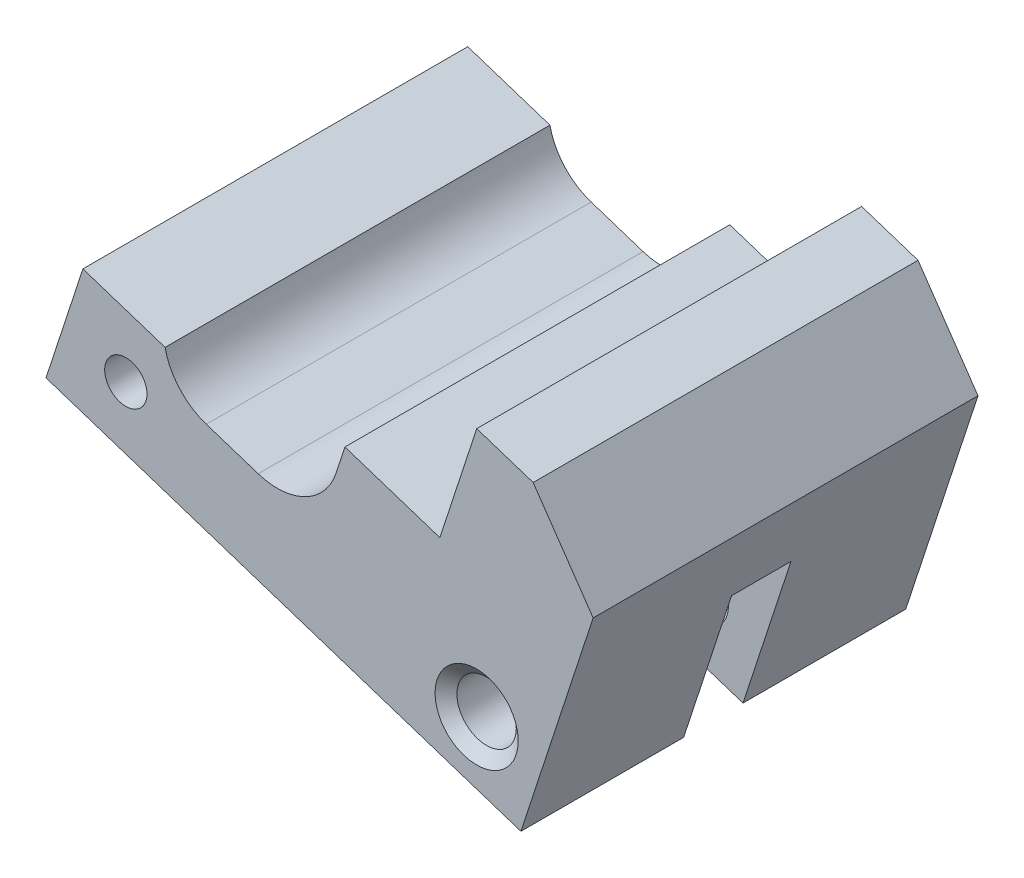
ISO-10303-21;
HEADER;
FILE_DESCRIPTION(('STEP AP214'),'2;1');
FILE_NAME('part.step','',(''),(''),'','','');
FILE_SCHEMA(('AUTOMOTIVE_DESIGN { 1 0 10303 214 1 1 1 1 }'));
ENDSEC;
DATA;
#1=APPLICATION_CONTEXT('core data for automotive mechanical design processes');
#2=APPLICATION_PROTOCOL_DEFINITION('international standard','automotive_design',2000,#1);
#3=PRODUCT_CONTEXT('',#1,'mechanical');
#4=PRODUCT('Part','Part','',(#3));
#5=PRODUCT_RELATED_PRODUCT_CATEGORY('part','',(#4));
#6=PRODUCT_DEFINITION_FORMATION('','',#4);
#7=PRODUCT_DEFINITION_CONTEXT('part definition',#1,'design');
#8=PRODUCT_DEFINITION('design','',#6,#7);
#9=PRODUCT_DEFINITION_SHAPE('','',#8);
#10=(LENGTH_UNIT() NAMED_UNIT(*) SI_UNIT(.MILLI.,.METRE.));
#11=(NAMED_UNIT(*) PLANE_ANGLE_UNIT() SI_UNIT($,.RADIAN.));
#12=(NAMED_UNIT(*) SI_UNIT($,.STERADIAN.) SOLID_ANGLE_UNIT());
#13=UNCERTAINTY_MEASURE_WITH_UNIT(LENGTH_MEASURE(1.E-05),#10,'distance_accuracy_value','');
#14=(GEOMETRIC_REPRESENTATION_CONTEXT(3) GLOBAL_UNCERTAINTY_ASSIGNED_CONTEXT((#13)) GLOBAL_UNIT_ASSIGNED_CONTEXT((#10,
#11,#12)) REPRESENTATION_CONTEXT('',''));
#15=CARTESIAN_POINT('',(0.,0.,0.));
#16=DIRECTION('',(0.,0.,1.));
#17=DIRECTION('',(1.,0.,0.));
#18=AXIS2_PLACEMENT_3D('',#15,#16,#17);
#19=CARTESIAN_POINT('',(8.99758083651037,-79.2807795563103,21.8561432963201));
#20=DIRECTION('',(0.,0.,1.));
#21=DIRECTION('',(1.,0.,0.));
#22=AXIS2_PLACEMENT_3D('',#19,#20,#21);
#23=CYLINDRICAL_SURFACE('',#22,1.5875);
#24=CARTESIAN_POINT('',(8.99758083651037,-79.2807795563103,9.97557164816008));
#25=DIRECTION('',(0.,0.,-1.));
#26=DIRECTION('',(-1.,0.,0.));
#27=AXIS2_PLACEMENT_3D('',#24,#25,#26);
#28=CIRCLE('',#27,1.5875);
#29=CARTESIAN_POINT('',(7.41008083651038,-79.2807795563103,9.97557164816008));
#30=VERTEX_POINT('',#29);
#31=EDGE_CURVE('E206',#30,#30,#28,.F.);
#32=ORIENTED_EDGE('',*,*,#31,.T.);
#33=EDGE_LOOP('',(#32));
#34=FACE_BOUND('',#33,.T.);
#35=CARTESIAN_POINT('',(8.99758083651037,-79.2807795563103,1.27));
#36=DIRECTION('',(0.,0.,1.));
#37=DIRECTION('',(1.,0.,0.));
#38=AXIS2_PLACEMENT_3D('',#35,#36,#37);
#39=CIRCLE('',#38,1.5875);
#40=CARTESIAN_POINT('',(10.5850808365104,-79.2807795563103,1.27));
#41=VERTEX_POINT('',#40);
#42=EDGE_CURVE('E218',#41,#41,#39,.T.);
#43=ORIENTED_EDGE('',*,*,#42,.F.);
#44=EDGE_LOOP('',(#43));
#45=FACE_BOUND('',#44,.T.);
#46=ADVANCED_FACE('F37',(#34,#45),#23,.F.);
#47=CARTESIAN_POINT('',(-34.8598381796,-193.67470749233,21.85614329632));
#48=DIRECTION('',(0.,0.,-1.));
#49=DIRECTION('',(-0.999995874513973,-0.00287244756860379,0.));
#50=AXIS2_PLACEMENT_3D('',#47,#48,#49);
#51=PLANE('',#50);
#52=CARTESIAN_POINT('',(8.99758083651037,-79.2807795563103,21.8561432963201));
#53=DIRECTION('',(0.,0.,1.));
#54=DIRECTION('',(1.,0.,0.));
#55=AXIS2_PLACEMENT_3D('',#52,#53,#54);
#56=CIRCLE('',#55,2.2225);
#57=CARTESIAN_POINT('',(11.2200808365104,-79.2807795563103,21.8561432963201));
#58=VERTEX_POINT('',#57);
#59=EDGE_CURVE('E209',#58,#58,#56,.T.);
#60=ORIENTED_EDGE('',*,*,#59,.F.);
#61=EDGE_LOOP('',(#60));
#62=FACE_BOUND('',#61,.T.);
#63=DIRECTION('',(0.950482556507389,-0.310777910693759,0.));
#64=VECTOR('',#63,1.);
#65=CARTESIAN_POINT('',(7.02998574408476,-71.9566208494996,21.8561432963201));
#66=LINE('',#65,#64);
#67=CARTESIAN_POINT('',(1.9525643231755,-70.296463690277,21.8561432963201));
#68=VERTEX_POINT('',#67);
#69=CARTESIAN_POINT('',(7.02998574408469,-71.9566208494996,21.8561432963201));
#70=VERTEX_POINT('',#69);
#71=EDGE_CURVE('E203',#68,#70,#66,.T.);
#72=ORIENTED_EDGE('',*,*,#71,.F.);
#73=DIRECTION('',(0.310777910693755,0.950482556507391,0.));
#74=VECTOR('',#73,1.);
#75=CARTESIAN_POINT('',(22.5287809016616,-7.36620299989832,21.8561432963201));
#76=LINE('',#75,#74);
#77=CARTESIAN_POINT('',(1.47893878727822,-71.7449991063943,21.8561432963201));
#78=VERTEX_POINT('',#77);
#79=EDGE_CURVE('E52',#78,#68,#76,.T.);
#80=ORIENTED_EDGE('',*,*,#79,.F.);
#81=CARTESIAN_POINT('',(-1.65955461430918,-70.7188104452835,21.8561432963201));
#82=DIRECTION('',(0.,0.,1.));
#83=DIRECTION('',(1.,0.,0.));
#84=AXIS2_PLACEMENT_3D('',#81,#82,#83);
#85=CIRCLE('',#84,3.302);
#86=CARTESIAN_POINT('',(-2.68574327541997,-73.8573038468709,21.8561432963201));
#87=VERTEX_POINT('',#86);
#88=EDGE_CURVE('E303',#87,#78,#85,.T.);
#89=ORIENTED_EDGE('',*,*,#88,.F.);
#90=DIRECTION('',(-0.95048255650739,0.310777910693756,0.));
#91=VECTOR('',#90,1.);
#92=CARTESIAN_POINT('',(-22.0760307754942,-67.5172895080833,21.8561432963201));
#93=LINE('',#92,#91);
#94=CARTESIAN_POINT('',(-5.46210282297806,-72.9495215697344,21.8561432963201));
#95=VERTEX_POINT('',#94);
#96=EDGE_CURVE('E301',#87,#95,#93,.T.);
#97=ORIENTED_EDGE('',*,*,#96,.T.);
#98=CARTESIAN_POINT('',(-4.43591416186727,-69.811028168147,21.8561432963201));
#99=DIRECTION('',(0.,0.,1.));
#100=DIRECTION('',(1.,0.,0.));
#101=AXIS2_PLACEMENT_3D('',#98,#99,#100);
#102=CIRCLE('',#101,3.30199999999999);
#103=CARTESIAN_POINT('',(-7.66702350780718,-70.4915694193432,21.8561432963201));
#104=VERTEX_POINT('',#103);
#105=EDGE_CURVE('E298',#104,#95,#102,.T.);
#106=ORIENTED_EDGE('',*,*,#105,.F.);
#107=DIRECTION('',(0.950482556507389,-0.310777910693759,0.));
#108=VECTOR('',#107,1.);
#109=CARTESIAN_POINT('',(0.00770164381015448,-73.0009632335052,21.8561432963201));
#110=LINE('',#109,#108);
#111=CARTESIAN_POINT('',(-12.0634268238338,-69.0540837676944,21.8561432963201));
#112=VERTEX_POINT('',#111);
#113=EDGE_CURVE('E170',#112,#104,#110,.T.);
#114=ORIENTED_EDGE('',*,*,#113,.F.);
#115=DIRECTION('',(0.310777910693759,0.950482556507389,0.));
#116=VECTOR('',#115,1.);
#117=CARTESIAN_POINT('',(-12.0634268238337,-69.0540837676944,21.8561432963201));
#118=LINE('',#117,#116);
#119=CARTESIAN_POINT('',(-14.0368665567391,-75.0896480015163,21.8561432963201));
#120=VERTEX_POINT('',#119);
#121=EDGE_CURVE('E45',#120,#112,#118,.T.);
#122=ORIENTED_EDGE('',*,*,#121,.F.);
#123=DIRECTION('',(-0.950482556507389,0.310777910693758,0.));
#124=VECTOR('',#123,1.);
#125=CARTESIAN_POINT('',(-14.0368665567391,-75.0896480015164,21.8561432963201));
#126=LINE('',#125,#124);
#127=CARTESIAN_POINT('',(11.3653114031524,-83.3953614934659,21.8561432963202));
#128=VERTEX_POINT('',#127);
#129=EDGE_CURVE('E244',#128,#120,#126,.T.);
#130=ORIENTED_EDGE('',*,*,#129,.F.);
#131=DIRECTION('',(-0.310777910693758,-0.950482556507389,0.));
#132=VECTOR('',#131,1.);
#133=CARTESIAN_POINT('',(11.3653114031524,-83.3953614934658,21.8561432963202));
#134=LINE('',#133,#132);
#135=CARTESIAN_POINT('',(15.2291208064125,-71.5782943432628,21.8561432963202));
#136=VERTEX_POINT('',#135);
#137=EDGE_CURVE('E241',#136,#128,#134,.T.);
#138=ORIENTED_EDGE('',*,*,#137,.F.);
#139=DIRECTION('',(0.566161107256144,-0.824294607910605,0.));
#140=VECTOR('',#139,1.);
#141=CARTESIAN_POINT('',(12.021207593901,-66.9077764821303,21.8561432963202));
#142=LINE('',#141,#140);
#143=CARTESIAN_POINT('',(12.021207593901,-66.9077764821303,21.8561432963202));
#144=VERTEX_POINT('',#143);
#145=EDGE_CURVE('E238',#144,#136,#142,.T.);
#146=ORIENTED_EDGE('',*,*,#145,.F.);
#147=DIRECTION('',(0.950482556507389,-0.310777910693759,0.));
#148=VECTOR('',#147,1.);
#149=CARTESIAN_POINT('',(12.0212075939011,-66.9077764821303,21.8561432963202));
#150=LINE('',#149,#148);
#151=CARTESIAN_POINT('',(9.00342547699006,-65.9210566156776,21.8561432963201));
#152=VERTEX_POINT('',#151);
#153=EDGE_CURVE('E235',#152,#144,#150,.T.);
#154=ORIENTED_EDGE('',*,*,#153,.F.);
#155=DIRECTION('',(0.310777910693759,0.950482556507389,0.));
#156=VECTOR('',#155,1.);
#157=CARTESIAN_POINT('',(8.01670561053738,-68.9388387325886,21.8561432963201));
#158=LINE('',#157,#156);
#159=EDGE_CURVE('E232',#70,#152,#158,.T.);
#160=ORIENTED_EDGE('',*,*,#159,.F.);
#161=EDGE_LOOP('',(#72,#80,#89,#97,#106,#114,#122,#130,#138,#146,#154,#160));
#162=FACE_BOUND('',#161,.T.);
#163=CARTESIAN_POINT('',(-9.76679974708732,-73.1454170993059,21.8561432963201));
#164=DIRECTION('',(0.,0.,1.));
#165=DIRECTION('',(1.,0.,0.));
#166=AXIS2_PLACEMENT_3D('',#163,#164,#165);
#167=CIRCLE('',#166,1.13029999999999);
#168=CARTESIAN_POINT('',(-8.63649974708733,-73.1454170993059,21.8561432963201));
#169=VERTEX_POINT('',#168);
#170=EDGE_CURVE('E225',#169,#169,#167,.T.);
#171=ORIENTED_EDGE('',*,*,#170,.F.);
#172=EDGE_LOOP('',(#171));
#173=FACE_BOUND('',#172,.T.);
#174=ADVANCED_FACE('F277',(#62,#162,#173),#51,.F.);
#175=CARTESIAN_POINT('',(0.,0.,1.27));
#176=DIRECTION('',(0.,0.,1.));
#177=DIRECTION('',(1.,0.,0.));
#178=AXIS2_PLACEMENT_3D('',#175,#176,#177);
#179=PLANE('',#178);
#180=ORIENTED_EDGE('',*,*,#42,.T.);
#181=EDGE_LOOP('',(#180));
#182=FACE_BOUND('',#181,.T.);
#183=CARTESIAN_POINT('',(-9.76679974708732,-73.1454170993059,1.27));
#184=DIRECTION('',(0.,0.,1.));
#185=DIRECTION('',(1.,0.,0.));
#186=AXIS2_PLACEMENT_3D('',#183,#184,#185);
#187=CIRCLE('',#186,1.13029999999999);
#188=CARTESIAN_POINT('',(-8.63649974708732,-73.1454170993059,1.27));
#189=VERTEX_POINT('',#188);
#190=EDGE_CURVE('E228',#189,#189,#187,.T.);
#191=ORIENTED_EDGE('',*,*,#190,.T.);
#192=EDGE_LOOP('',(#191));
#193=FACE_BOUND('',#192,.T.);
#194=CARTESIAN_POINT('',(-1.65955461430918,-70.7188104452835,1.27));
#195=DIRECTION('',(0.,0.,1.));
#196=DIRECTION('',(1.,0.,0.));
#197=AXIS2_PLACEMENT_3D('',#194,#195,#196);
#198=CIRCLE('',#197,3.302);
#199=CARTESIAN_POINT('',(-2.68574327541997,-73.8573038468709,1.27));
#200=VERTEX_POINT('',#199);
#201=CARTESIAN_POINT('',(1.47893878727822,-71.7449991063943,1.27));
#202=VERTEX_POINT('',#201);
#203=EDGE_CURVE('E562',#200,#202,#198,.T.);
#204=ORIENTED_EDGE('',*,*,#203,.T.);
#205=DIRECTION('',(0.310777910693755,0.950482556507391,0.));
#206=VECTOR('',#205,1.);
#207=CARTESIAN_POINT('',(22.5287809016616,-7.36620299989832,1.27));
#208=LINE('',#207,#206);
#209=CARTESIAN_POINT('',(1.9525643231755,-70.296463690277,1.27));
#210=VERTEX_POINT('',#209);
#211=EDGE_CURVE('E171',#202,#210,#208,.T.);
#212=ORIENTED_EDGE('',*,*,#211,.T.);
#213=DIRECTION('',(-0.950482556507389,0.310777910693759,0.));
#214=VECTOR('',#213,1.);
#215=CARTESIAN_POINT('',(7.02998574408469,-71.9566208494996,1.27));
#216=LINE('',#215,#214);
#217=CARTESIAN_POINT('',(7.02998574408469,-71.9566208494996,1.27));
#218=VERTEX_POINT('',#217);
#219=EDGE_CURVE('E180',#218,#210,#216,.T.);
#220=ORIENTED_EDGE('',*,*,#219,.F.);
#221=DIRECTION('',(-0.310777910693759,-0.950482556507389,0.));
#222=VECTOR('',#221,1.);
#223=CARTESIAN_POINT('',(8.01670561053737,-68.9388387325886,1.27));
#224=LINE('',#223,#222);
#225=CARTESIAN_POINT('',(9.00342547699006,-65.9210566156776,1.27));
#226=VERTEX_POINT('',#225);
#227=EDGE_CURVE('E185',#226,#218,#224,.T.);
#228=ORIENTED_EDGE('',*,*,#227,.F.);
#229=DIRECTION('',(-0.950482556507389,0.310777910693759,0.));
#230=VECTOR('',#229,1.);
#231=CARTESIAN_POINT('',(12.021207593901,-66.9077764821303,1.27));
#232=LINE('',#231,#230);
#233=CARTESIAN_POINT('',(12.021207593901,-66.9077764821303,1.27));
#234=VERTEX_POINT('',#233);
#235=EDGE_CURVE('E259',#234,#226,#232,.T.);
#236=ORIENTED_EDGE('',*,*,#235,.F.);
#237=DIRECTION('',(-0.566161107256144,0.824294607910605,0.));
#238=VECTOR('',#237,1.);
#239=CARTESIAN_POINT('',(12.021207593901,-66.9077764821303,1.27));
#240=LINE('',#239,#238);
#241=CARTESIAN_POINT('',(15.2291208064125,-71.5782943432628,1.27));
#242=VERTEX_POINT('',#241);
#243=EDGE_CURVE('E256',#242,#234,#240,.T.);
#244=ORIENTED_EDGE('',*,*,#243,.F.);
#245=DIRECTION('',(0.310777910693758,0.950482556507389,0.));
#246=VECTOR('',#245,1.);
#247=CARTESIAN_POINT('',(11.3653114031524,-83.3953614934659,1.27));
#248=LINE('',#247,#246);
#249=CARTESIAN_POINT('',(11.3653114031524,-83.3953614934659,1.27));
#250=VERTEX_POINT('',#249);
#251=EDGE_CURVE('E253',#250,#242,#248,.T.);
#252=ORIENTED_EDGE('',*,*,#251,.F.);
#253=DIRECTION('',(0.950482556507389,-0.310777910693758,0.));
#254=VECTOR('',#253,1.);
#255=CARTESIAN_POINT('',(-14.0368665567391,-75.0896480015163,1.27));
#256=LINE('',#255,#254);
#257=CARTESIAN_POINT('',(-14.0368665567391,-75.0896480015163,1.27));
#258=VERTEX_POINT('',#257);
#259=EDGE_CURVE('E250',#258,#250,#256,.T.);
#260=ORIENTED_EDGE('',*,*,#259,.F.);
#261=DIRECTION('',(-0.310777910693759,-0.950482556507389,0.));
#262=VECTOR('',#261,1.);
#263=CARTESIAN_POINT('',(-12.0634268238338,-69.0540837676944,1.27));
#264=LINE('',#263,#262);
#265=CARTESIAN_POINT('',(-12.0634268238338,-69.0540837676944,1.27));
#266=VERTEX_POINT('',#265);
#267=EDGE_CURVE('E178',#266,#258,#264,.T.);
#268=ORIENTED_EDGE('',*,*,#267,.F.);
#269=DIRECTION('',(-0.950482556507389,0.310777910693759,0.));
#270=VECTOR('',#269,1.);
#271=CARTESIAN_POINT('',(0.00770164381008439,-73.0009632335051,1.27));
#272=LINE('',#271,#270);
#273=CARTESIAN_POINT('',(-7.66702350780718,-70.4915694193432,1.27));
#274=VERTEX_POINT('',#273);
#275=EDGE_CURVE('E168',#274,#266,#272,.T.);
#276=ORIENTED_EDGE('',*,*,#275,.F.);
#277=CARTESIAN_POINT('',(-4.43591416186727,-69.811028168147,1.27));
#278=DIRECTION('',(0.,0.,1.));
#279=DIRECTION('',(1.,0.,0.));
#280=AXIS2_PLACEMENT_3D('',#277,#278,#279);
#281=CIRCLE('',#280,3.30199999999999);
#282=CARTESIAN_POINT('',(-5.46210282297806,-72.9495215697344,1.27));
#283=VERTEX_POINT('',#282);
#284=EDGE_CURVE('E152',#274,#283,#281,.T.);
#285=ORIENTED_EDGE('',*,*,#284,.T.);
#286=DIRECTION('',(-0.95048255650739,0.310777910693756,0.));
#287=VECTOR('',#286,1.);
#288=CARTESIAN_POINT('',(-22.0760307754942,-67.5172895080833,1.27));
#289=LINE('',#288,#287);
#290=EDGE_CURVE('E162',#200,#283,#289,.T.);
#291=ORIENTED_EDGE('',*,*,#290,.F.);
#292=EDGE_LOOP('',(#204,#212,#220,#228,#236,#244,#252,#260,#268,#276,#285,#291));
#293=FACE_BOUND('',#292,.T.);
#294=ADVANCED_FACE('F175',(#182,#193,#293),#179,.F.);
#295=CARTESIAN_POINT('',(0.00770164381008439,-73.0009632335051,57.2120545691913));
#296=DIRECTION('',(-0.310777910693759,-0.950482556507389,0.));
#297=DIRECTION('',(0.950482556507389,-0.310777910693759,0.));
#298=AXIS2_PLACEMENT_3D('',#295,#296,#297);
#299=PLANE('',#298);
#300=ORIENTED_EDGE('',*,*,#113,.T.);
#301=DIRECTION('',(0.,0.,1.));
#302=VECTOR('',#301,1.);
#303=CARTESIAN_POINT('',(-7.66702350780718,-70.4915694193432,1.27));
#304=LINE('',#303,#302);
#305=EDGE_CURVE('E156',#274,#104,#304,.T.);
#306=ORIENTED_EDGE('',*,*,#305,.F.);
#307=ORIENTED_EDGE('',*,*,#275,.T.);
#308=DIRECTION('',(0.,0.,-1.));
#309=VECTOR('',#308,1.);
#310=CARTESIAN_POINT('',(-12.0634268238338,-69.0540837676944,57.2120545691913));
#311=LINE('',#310,#309);
#312=EDGE_CURVE('E179',#112,#266,#311,.T.);
#313=ORIENTED_EDGE('',*,*,#312,.F.);
#314=EDGE_LOOP('',(#300,#306,#307,#313));
#315=FACE_BOUND('',#314,.T.);
#316=ADVANCED_FACE('F166',(#315),#299,.F.);
#317=CARTESIAN_POINT('',(7.02998574408469,-71.9566208494996,57.2120545691913));
#318=DIRECTION('',(-0.310777910693759,-0.950482556507389,0.));
#319=DIRECTION('',(0.950482556507389,-0.310777910693759,0.));
#320=AXIS2_PLACEMENT_3D('',#317,#318,#319);
#321=PLANE('',#320);
#322=ORIENTED_EDGE('',*,*,#219,.T.);
#323=DIRECTION('',(0.,0.,1.));
#324=VECTOR('',#323,1.);
#325=CARTESIAN_POINT('',(1.9525643231755,-70.296463690277,1.27));
#326=LINE('',#325,#324);
#327=EDGE_CURVE('E273',#210,#68,#326,.T.);
#328=ORIENTED_EDGE('',*,*,#327,.T.);
#329=ORIENTED_EDGE('',*,*,#71,.T.);
#330=DIRECTION('',(0.,0.,-1.));
#331=VECTOR('',#330,1.);
#332=CARTESIAN_POINT('',(7.02998574408469,-71.9566208494996,57.2120545691913));
#333=LINE('',#332,#331);
#334=EDGE_CURVE('E182',#70,#218,#333,.T.);
#335=ORIENTED_EDGE('',*,*,#334,.T.);
#336=EDGE_LOOP('',(#322,#328,#329,#335));
#337=FACE_BOUND('',#336,.T.);
#338=ADVANCED_FACE('F272',(#337),#321,.F.);
#339=CARTESIAN_POINT('',(8.01670561053737,-68.9388387325886,57.2120545691913));
#340=DIRECTION('',(0.950482556507389,-0.310777910693759,0.));
#341=DIRECTION('',(0.310777910693759,0.950482556507389,0.));
#342=AXIS2_PLACEMENT_3D('',#339,#340,#341);
#343=PLANE('',#342);
#344=ORIENTED_EDGE('',*,*,#334,.F.);
#345=ORIENTED_EDGE('',*,*,#159,.T.);
#346=DIRECTION('',(0.,0.,-1.));
#347=VECTOR('',#346,1.);
#348=CARTESIAN_POINT('',(9.00342547699006,-65.9210566156776,57.2120545691913));
#349=LINE('',#348,#347);
#350=EDGE_CURVE('E190',#152,#226,#349,.T.);
#351=ORIENTED_EDGE('',*,*,#350,.T.);
#352=ORIENTED_EDGE('',*,*,#227,.T.);
#353=EDGE_LOOP('',(#344,#345,#351,#352));
#354=FACE_BOUND('',#353,.T.);
#355=ADVANCED_FACE('F266',(#354),#343,.F.);
#356=CARTESIAN_POINT('',(12.021207593901,-66.9077764821303,57.2120545691913));
#357=DIRECTION('',(-0.310777910693759,-0.950482556507389,0.));
#358=DIRECTION('',(0.950482556507389,-0.310777910693759,0.));
#359=AXIS2_PLACEMENT_3D('',#356,#357,#358);
#360=PLANE('',#359);
#361=ORIENTED_EDGE('',*,*,#350,.F.);
#362=ORIENTED_EDGE('',*,*,#153,.T.);
#363=DIRECTION('',(0.,0.,-1.));
#364=VECTOR('',#363,1.);
#365=CARTESIAN_POINT('',(12.021207593901,-66.9077764821303,57.2120545691913));
#366=LINE('',#365,#364);
#367=EDGE_CURVE('E192',#144,#234,#366,.T.);
#368=ORIENTED_EDGE('',*,*,#367,.T.);
#369=ORIENTED_EDGE('',*,*,#235,.T.);
#370=EDGE_LOOP('',(#361,#362,#368,#369));
#371=FACE_BOUND('',#370,.T.);
#372=ADVANCED_FACE('F281',(#371),#360,.F.);
#373=CARTESIAN_POINT('',(12.021207593901,-66.9077764821303,57.2120545691913));
#374=DIRECTION('',(-0.824294607910604,-0.566161107256144,0.));
#375=DIRECTION('',(0.566161107256144,-0.824294607910605,0.));
#376=AXIS2_PLACEMENT_3D('',#373,#374,#375);
#377=PLANE('',#376);
#378=ORIENTED_EDGE('',*,*,#367,.F.);
#379=ORIENTED_EDGE('',*,*,#145,.T.);
#380=DIRECTION('',(0.,0.,-1.));
#381=VECTOR('',#380,1.);
#382=CARTESIAN_POINT('',(15.2291208064125,-71.5782943432628,57.2120545691913));
#383=LINE('',#382,#381);
#384=EDGE_CURVE('E194',#136,#242,#383,.T.);
#385=ORIENTED_EDGE('',*,*,#384,.T.);
#386=ORIENTED_EDGE('',*,*,#243,.T.);
#387=EDGE_LOOP('',(#378,#379,#385,#386));
#388=FACE_BOUND('',#387,.T.);
#389=ADVANCED_FACE('F285',(#388),#377,.F.);
#390=CARTESIAN_POINT('',(11.3653114031524,-83.3953614934659,57.2120545691913));
#391=DIRECTION('',(-0.950482556507389,0.310777910693758,0.));
#392=DIRECTION('',(-0.310777910693758,-0.950482556507389,0.));
#393=AXIS2_PLACEMENT_3D('',#390,#391,#392);
#394=PLANE('',#393);
#395=DIRECTION('',(0.,0.,-1.));
#396=VECTOR('',#395,1.);
#397=CARTESIAN_POINT('',(13.9307830559294,-75.5491279894974,57.2120545691913));
#398=LINE('',#397,#396);
#399=CARTESIAN_POINT('',(13.9307830559294,-75.5491279894974,13.1505716481601));
#400=VERTEX_POINT('',#399);
#401=CARTESIAN_POINT('',(13.9307830559294,-75.5491279894974,9.97557164816008));
#402=VERTEX_POINT('',#401);
#403=EDGE_CURVE('E12',#400,#402,#398,.T.);
#404=ORIENTED_EDGE('',*,*,#403,.T.);
#405=DIRECTION('',(-0.310777910693758,-0.950482556507389,0.));
#406=VECTOR('',#405,1.);
#407=CARTESIAN_POINT('',(13.9307830559294,-75.5491279894974,9.97557164816008));
#408=LINE('',#407,#406);
#409=CARTESIAN_POINT('',(11.3653114031524,-83.3953614934659,9.97557164816008));
#410=VERTEX_POINT('',#409);
#411=EDGE_CURVE('E207',#402,#410,#408,.T.);
#412=ORIENTED_EDGE('',*,*,#411,.T.);
#413=DIRECTION('',(0.,0.,-1.));
#414=VECTOR('',#413,1.);
#415=CARTESIAN_POINT('',(11.3653114031524,-83.3953614934659,57.2120545691913));
#416=LINE('',#415,#414);
#417=EDGE_CURVE('E196',#410,#250,#416,.T.);
#418=ORIENTED_EDGE('',*,*,#417,.T.);
#419=ORIENTED_EDGE('',*,*,#251,.T.);
#420=ORIENTED_EDGE('',*,*,#384,.F.);
#421=ORIENTED_EDGE('',*,*,#137,.T.);
#422=CARTESIAN_POINT('',(11.3653114031524,-83.3953614934659,13.1505716481601));
#423=VERTEX_POINT('',#422);
#424=EDGE_CURVE('E197',#128,#423,#416,.T.);
#425=ORIENTED_EDGE('',*,*,#424,.T.);
#426=DIRECTION('',(-0.310777910693758,-0.950482556507389,0.));
#427=VECTOR('',#426,1.);
#428=CARTESIAN_POINT('',(13.9307830559294,-75.5491279894974,13.1505716481601));
#429=LINE('',#428,#427);
#430=EDGE_CURVE('E60',#400,#423,#429,.T.);
#431=ORIENTED_EDGE('',*,*,#430,.F.);
#432=EDGE_LOOP('',(#404,#412,#418,#419,#420,#421,#425,#431));
#433=FACE_BOUND('',#432,.T.);
#434=ADVANCED_FACE('F288',(#433),#394,.F.);
#435=CARTESIAN_POINT('',(-14.0368665567391,-75.0896480015163,57.2120545691913));
#436=DIRECTION('',(0.310777910693758,0.950482556507389,0.));
#437=DIRECTION('',(-0.950482556507389,0.310777910693758,0.));
#438=AXIS2_PLACEMENT_3D('',#435,#436,#437);
#439=PLANE('',#438);
#440=ORIENTED_EDGE('',*,*,#417,.F.);
#441=DIRECTION('',(0.950482556507389,-0.310777910693759,0.));
#442=VECTOR('',#441,1.);
#443=CARTESIAN_POINT('',(11.3653114031524,-83.3953614934659,9.97557164816008));
#444=LINE('',#443,#442);
#445=CARTESIAN_POINT('',(1.70840862903732,-80.2378579208173,9.97557164816007));
#446=VERTEX_POINT('',#445);
#447=EDGE_CURVE('E322',#446,#410,#444,.T.);
#448=ORIENTED_EDGE('',*,*,#447,.F.);
#449=CARTESIAN_POINT('',(1.70840862903732,-80.2378579208173,11.5630716481601));
#450=DIRECTION('',(-0.310777910693758,-0.950482556507389,0.));
#451=DIRECTION('',(0.950482556507389,-0.310777910693758,0.));
#452=AXIS2_PLACEMENT_3D('',#449,#450,#451);
#453=CIRCLE('',#452,1.5875);
#454=CARTESIAN_POINT('',(1.70840862903732,-80.2378579208173,13.1505716481601));
#455=VERTEX_POINT('',#454);
#456=EDGE_CURVE('E329',#455,#446,#453,.T.);
#457=ORIENTED_EDGE('',*,*,#456,.F.);
#458=DIRECTION('',(-0.950482556507389,0.310777910693759,0.));
#459=VECTOR('',#458,1.);
#460=CARTESIAN_POINT('',(11.3653114031524,-83.3953614934659,13.1505716481601));
#461=LINE('',#460,#459);
#462=EDGE_CURVE('E312',#423,#455,#461,.T.);
#463=ORIENTED_EDGE('',*,*,#462,.F.);
#464=ORIENTED_EDGE('',*,*,#424,.F.);
#465=ORIENTED_EDGE('',*,*,#129,.T.);
#466=DIRECTION('',(0.,0.,-1.));
#467=VECTOR('',#466,1.);
#468=CARTESIAN_POINT('',(-14.0368665567391,-75.0896480015163,57.2120545691913));
#469=LINE('',#468,#467);
#470=EDGE_CURVE('E200',#120,#258,#469,.T.);
#471=ORIENTED_EDGE('',*,*,#470,.T.);
#472=ORIENTED_EDGE('',*,*,#259,.T.);
#473=EDGE_LOOP('',(#440,#448,#457,#463,#464,#465,#471,#472));
#474=FACE_BOUND('',#473,.T.);
#475=ADVANCED_FACE('F293',(#474),#439,.F.);
#476=CARTESIAN_POINT('',(-12.0634268238338,-69.0540837676944,57.2120545691913));
#477=DIRECTION('',(0.950482556507389,-0.310777910693759,0.));
#478=DIRECTION('',(0.310777910693759,0.950482556507389,0.));
#479=AXIS2_PLACEMENT_3D('',#476,#477,#478);
#480=PLANE('',#479);
#481=ORIENTED_EDGE('',*,*,#470,.F.);
#482=ORIENTED_EDGE('',*,*,#121,.T.);
#483=ORIENTED_EDGE('',*,*,#312,.T.);
#484=ORIENTED_EDGE('',*,*,#267,.T.);
#485=EDGE_LOOP('',(#481,#482,#483,#484));
#486=FACE_BOUND('',#485,.T.);
#487=ADVANCED_FACE('F39',(#486),#480,.F.);
#488=CARTESIAN_POINT('',(-9.76679974708732,-73.1454170993059,21.8561432963201));
#489=DIRECTION('',(0.,0.,1.));
#490=DIRECTION('',(1.,0.,0.));
#491=AXIS2_PLACEMENT_3D('',#488,#489,#490);
#492=CYLINDRICAL_SURFACE('',#491,1.13029999999999);
#493=ORIENTED_EDGE('',*,*,#190,.F.);
#494=EDGE_LOOP('',(#493));
#495=FACE_BOUND('',#494,.T.);
#496=ORIENTED_EDGE('',*,*,#170,.T.);
#497=EDGE_LOOP('',(#496));
#498=FACE_BOUND('',#497,.T.);
#499=ADVANCED_FACE('F370',(#495,#498),#492,.F.);
#500=CARTESIAN_POINT('',(8.99758083651037,-79.2807795563103,13.1505716481601));
#501=DIRECTION('',(0.,0.,1.));
#502=DIRECTION('',(1.,0.,0.));
#503=AXIS2_PLACEMENT_3D('',#500,#501,#502);
#504=CIRCLE('',#503,1.5875);
#505=CARTESIAN_POINT('',(10.5850808365104,-79.2807795563103,13.1505716481601));
#506=VERTEX_POINT('',#505);
#507=EDGE_CURVE('E204',#506,#506,#504,.F.);
#508=ORIENTED_EDGE('',*,*,#507,.T.);
#509=EDGE_LOOP('',(#508));
#510=FACE_BOUND('',#509,.T.);
#511=CARTESIAN_POINT('',(8.99758083651037,-79.2807795563103,21.3233150305226));
#512=DIRECTION('',(0.,0.,1.));
#513=DIRECTION('',(1.,0.,0.));
#514=AXIS2_PLACEMENT_3D('',#511,#512,#513);
#515=CIRCLE('',#514,1.5875);
#516=CARTESIAN_POINT('',(10.5850808365104,-79.2807795563103,21.3233150305226));
#517=VERTEX_POINT('',#516);
#518=EDGE_CURVE('E213',#517,#517,#515,.T.);
#519=ORIENTED_EDGE('',*,*,#518,.T.);
#520=EDGE_LOOP('',(#519));
#521=FACE_BOUND('',#520,.T.);
#522=ADVANCED_FACE('F356',(#510,#521),#23,.F.);
#523=CARTESIAN_POINT('',(8.99758083651037,-79.2807795563103,21.8561432963201));
#524=DIRECTION('',(0.,0.,1.));
#525=DIRECTION('',(1.,0.,0.));
#526=AXIS2_PLACEMENT_3D('',#523,#524,#525);
#527=CONICAL_SURFACE('',#526,2.2225,0.872664625997161);
#528=ORIENTED_EDGE('',*,*,#518,.F.);
#529=EDGE_LOOP('',(#528));
#530=FACE_BOUND('',#529,.T.);
#531=ORIENTED_EDGE('',*,*,#59,.T.);
#532=EDGE_LOOP('',(#531));
#533=FACE_BOUND('',#532,.T.);
#534=ADVANCED_FACE('F349',(#530,#533),#527,.F.);
#535=CARTESIAN_POINT('',(13.9307830559294,-75.5491279894974,11.5630716481601));
#536=DIRECTION('',(0.310777910693758,0.950482556507389,0.));
#537=DIRECTION('',(-0.950482556507389,0.310777910693758,0.));
#538=AXIS2_PLACEMENT_3D('',#535,#536,#537);
#539=PLANE('',#538);
#540=DIRECTION('',(-0.950482556507389,0.310777910693759,0.));
#541=VECTOR('',#540,1.);
#542=CARTESIAN_POINT('',(13.9307830559294,-75.5491279894974,13.1505716481601));
#543=LINE('',#542,#541);
#544=CARTESIAN_POINT('',(4.2738802818143,-72.3916244168488,13.1505716481601));
#545=VERTEX_POINT('',#544);
#546=EDGE_CURVE('E318',#400,#545,#543,.T.);
#547=ORIENTED_EDGE('',*,*,#546,.T.);
#548=CARTESIAN_POINT('',(4.2738802818143,-72.3916244168488,11.5630716481601));
#549=DIRECTION('',(-0.310777910693758,-0.950482556507389,0.));
#550=DIRECTION('',(0.950482556507389,-0.310777910693758,0.));
#551=AXIS2_PLACEMENT_3D('',#548,#549,#550);
#552=CIRCLE('',#551,1.5875);
#553=CARTESIAN_POINT('',(4.2738802818143,-72.3916244168488,9.97557164816007));
#554=VERTEX_POINT('',#553);
#555=EDGE_CURVE('E321',#545,#554,#552,.T.);
#556=ORIENTED_EDGE('',*,*,#555,.T.);
#557=DIRECTION('',(0.950482556507389,-0.310777910693759,0.));
#558=VECTOR('',#557,1.);
#559=CARTESIAN_POINT('',(13.9307830559294,-75.5491279894974,9.97557164816008));
#560=LINE('',#559,#558);
#561=EDGE_CURVE('E325',#554,#402,#560,.T.);
#562=ORIENTED_EDGE('',*,*,#561,.T.);
#563=ORIENTED_EDGE('',*,*,#403,.F.);
#564=EDGE_LOOP('',(#547,#556,#562,#563));
#565=FACE_BOUND('',#564,.T.);
#566=ADVANCED_FACE('F347',(#565),#539,.F.);
#567=CARTESIAN_POINT('',(13.9307830559294,-75.5491279894974,9.97557164816008));
#568=DIRECTION('',(0.,0.,-1.));
#569=DIRECTION('',(-1.,0.,0.));
#570=AXIS2_PLACEMENT_3D('',#567,#568,#569);
#571=PLANE('',#570);
#572=ORIENTED_EDGE('',*,*,#447,.T.);
#573=ORIENTED_EDGE('',*,*,#411,.F.);
#574=ORIENTED_EDGE('',*,*,#561,.F.);
#575=DIRECTION('',(-0.310777910693758,-0.950482556507389,0.));
#576=VECTOR('',#575,1.);
#577=CARTESIAN_POINT('',(4.2738802818143,-72.3916244168488,9.97557164816007));
#578=LINE('',#577,#576);
#579=EDGE_CURVE('E334',#554,#446,#578,.T.);
#580=ORIENTED_EDGE('',*,*,#579,.T.);
#581=EDGE_LOOP('',(#572,#573,#574,#580));
#582=FACE_BOUND('',#581,.T.);
#583=ORIENTED_EDGE('',*,*,#31,.F.);
#584=EDGE_LOOP('',(#583));
#585=FACE_BOUND('',#584,.T.);
#586=ADVANCED_FACE('F343',(#582,#585),#571,.F.);
#587=CARTESIAN_POINT('',(13.9307830559294,-75.5491279894974,13.1505716481601));
#588=DIRECTION('',(0.,0.,1.));
#589=DIRECTION('',(1.,0.,0.));
#590=AXIS2_PLACEMENT_3D('',#587,#588,#589);
#591=PLANE('',#590);
#592=ORIENTED_EDGE('',*,*,#462,.T.);
#593=DIRECTION('',(-0.310777910693758,-0.950482556507389,0.));
#594=VECTOR('',#593,1.);
#595=CARTESIAN_POINT('',(4.2738802818143,-72.3916244168488,13.1505716481601));
#596=LINE('',#595,#594);
#597=EDGE_CURVE('E335',#545,#455,#596,.T.);
#598=ORIENTED_EDGE('',*,*,#597,.F.);
#599=ORIENTED_EDGE('',*,*,#546,.F.);
#600=ORIENTED_EDGE('',*,*,#430,.T.);
#601=EDGE_LOOP('',(#592,#598,#599,#600));
#602=FACE_BOUND('',#601,.T.);
#603=ORIENTED_EDGE('',*,*,#507,.F.);
#604=EDGE_LOOP('',(#603));
#605=FACE_BOUND('',#604,.T.);
#606=ADVANCED_FACE('F340',(#602,#605),#591,.F.);
#607=CARTESIAN_POINT('',(4.2738802818143,-72.3916244168488,11.5630716481601));
#608=DIRECTION('',(-0.310777910693758,-0.950482556507389,0.));
#609=DIRECTION('',(0.950482556507389,-0.310777910693758,0.));
#610=AXIS2_PLACEMENT_3D('',#607,#608,#609);
#611=CYLINDRICAL_SURFACE('',#610,1.5875);
#612=ORIENTED_EDGE('',*,*,#456,.T.);
#613=ORIENTED_EDGE('',*,*,#579,.F.);
#614=ORIENTED_EDGE('',*,*,#555,.F.);
#615=ORIENTED_EDGE('',*,*,#597,.T.);
#616=EDGE_LOOP('',(#612,#613,#614,#615));
#617=FACE_BOUND('',#616,.T.);
#618=ADVANCED_FACE('F338',(#617),#611,.F.);
#619=CARTESIAN_POINT('',(22.5287809016616,-7.36620299989832,1.27));
#620=DIRECTION('',(0.95048255650739,-0.310777910693755,0.));
#621=DIRECTION('',(0.310777910693755,0.95048255650739,0.));
#622=AXIS2_PLACEMENT_3D('',#619,#620,#621);
#623=PLANE('',#622);
#624=ORIENTED_EDGE('',*,*,#79,.T.);
#625=ORIENTED_EDGE('',*,*,#327,.F.);
#626=ORIENTED_EDGE('',*,*,#211,.F.);
#627=DIRECTION('',(0.,0.,1.));
#628=VECTOR('',#627,1.);
#629=CARTESIAN_POINT('',(1.47893878727822,-71.7449991063943,1.27));
#630=LINE('',#629,#628);
#631=EDGE_CURVE('E313',#202,#78,#630,.T.);
#632=ORIENTED_EDGE('',*,*,#631,.T.);
#633=EDGE_LOOP('',(#624,#625,#626,#632));
#634=FACE_BOUND('',#633,.T.);
#635=ADVANCED_FACE('F384',(#634),#623,.F.);
#636=CARTESIAN_POINT('',(-1.65955461430918,-70.7188104452835,1.27));
#637=DIRECTION('',(0.,0.,1.));
#638=DIRECTION('',(1.,0.,0.));
#639=AXIS2_PLACEMENT_3D('',#636,#637,#638);
#640=CYLINDRICAL_SURFACE('',#639,3.302);
#641=ORIENTED_EDGE('',*,*,#88,.T.);
#642=ORIENTED_EDGE('',*,*,#631,.F.);
#643=ORIENTED_EDGE('',*,*,#203,.F.);
#644=DIRECTION('',(0.,0.,1.));
#645=VECTOR('',#644,1.);
#646=CARTESIAN_POINT('',(-2.68574327541997,-73.8573038468709,1.27));
#647=LINE('',#646,#645);
#648=EDGE_CURVE('E315',#200,#87,#647,.T.);
#649=ORIENTED_EDGE('',*,*,#648,.T.);
#650=EDGE_LOOP('',(#641,#642,#643,#649));
#651=FACE_BOUND('',#650,.T.);
#652=ADVANCED_FACE('F389',(#651),#640,.F.);
#653=CARTESIAN_POINT('',(-22.0760307754942,-67.5172895080833,1.27));
#654=DIRECTION('',(0.310777910693756,0.95048255650739,0.));
#655=DIRECTION('',(-0.95048255650739,0.310777910693756,0.));
#656=AXIS2_PLACEMENT_3D('',#653,#654,#655);
#657=PLANE('',#656);
#658=ORIENTED_EDGE('',*,*,#96,.F.);
#659=ORIENTED_EDGE('',*,*,#648,.F.);
#660=ORIENTED_EDGE('',*,*,#290,.T.);
#661=DIRECTION('',(0.,0.,1.));
#662=VECTOR('',#661,1.);
#663=CARTESIAN_POINT('',(-5.46210282297806,-72.9495215697344,1.27));
#664=LINE('',#663,#662);
#665=EDGE_CURVE('E158',#283,#95,#664,.T.);
#666=ORIENTED_EDGE('',*,*,#665,.T.);
#667=EDGE_LOOP('',(#658,#659,#660,#666));
#668=FACE_BOUND('',#667,.T.);
#669=ADVANCED_FACE('F394',(#668),#657,.T.);
#670=CARTESIAN_POINT('',(-4.43591416186727,-69.811028168147,1.27));
#671=DIRECTION('',(0.,0.,1.));
#672=DIRECTION('',(1.,0.,0.));
#673=AXIS2_PLACEMENT_3D('',#670,#671,#672);
#674=CYLINDRICAL_SURFACE('',#673,3.30199999999999);
#675=ORIENTED_EDGE('',*,*,#105,.T.);
#676=ORIENTED_EDGE('',*,*,#665,.F.);
#677=ORIENTED_EDGE('',*,*,#284,.F.);
#678=ORIENTED_EDGE('',*,*,#305,.T.);
#679=EDGE_LOOP('',(#675,#676,#677,#678));
#680=FACE_BOUND('',#679,.T.);
#681=ADVANCED_FACE('F155',(#680),#674,.F.);
#682=CLOSED_SHELL('',(#46,#174,#294,#316,#338,#355,#372,#389,#434,#475,#487,#499,#522,#534,#566,
#586,#606,#618,#635,#652,#669,#681));
#683=MANIFOLD_SOLID_BREP('B2',#682);
#684=ADVANCED_BREP_SHAPE_REPRESENTATION('',(#18,#683),#14);
#685=SHAPE_DEFINITION_REPRESENTATION(#9,#684);
ENDSEC;
END-ISO-10303-21;
